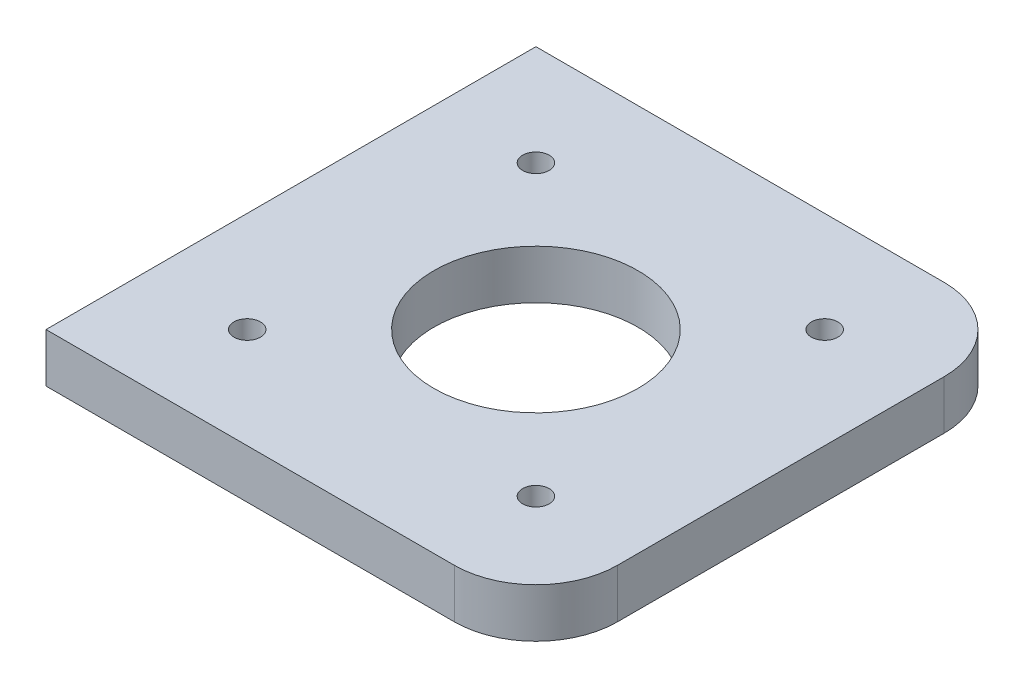
ISO-10303-21;
HEADER;
FILE_DESCRIPTION(('STEP AP214'),'2;1');
FILE_NAME('part.step','',(''),(''),'','','');
FILE_SCHEMA(('AUTOMOTIVE_DESIGN { 1 0 10303 214 1 1 1 1 }'));
ENDSEC;
DATA;
#1=APPLICATION_CONTEXT('core data for automotive mechanical design processes');
#2=APPLICATION_PROTOCOL_DEFINITION('international standard','automotive_design',2000,#1);
#3=PRODUCT_CONTEXT('',#1,'mechanical');
#4=PRODUCT('Part','Part','',(#3));
#5=PRODUCT_RELATED_PRODUCT_CATEGORY('part','',(#4));
#6=PRODUCT_DEFINITION_FORMATION('','',#4);
#7=PRODUCT_DEFINITION_CONTEXT('part definition',#1,'design');
#8=PRODUCT_DEFINITION('design','',#6,#7);
#9=PRODUCT_DEFINITION_SHAPE('','',#8);
#10=(LENGTH_UNIT() NAMED_UNIT(*) SI_UNIT(.MILLI.,.METRE.));
#11=(NAMED_UNIT(*) PLANE_ANGLE_UNIT() SI_UNIT($,.RADIAN.));
#12=(NAMED_UNIT(*) SI_UNIT($,.STERADIAN.) SOLID_ANGLE_UNIT());
#13=UNCERTAINTY_MEASURE_WITH_UNIT(LENGTH_MEASURE(1.E-05),#10,'distance_accuracy_value','');
#14=(GEOMETRIC_REPRESENTATION_CONTEXT(3) GLOBAL_UNCERTAINTY_ASSIGNED_CONTEXT((#13)) GLOBAL_UNIT_ASSIGNED_CONTEXT((#10,
#11,#12)) REPRESENTATION_CONTEXT('',''));
#15=CARTESIAN_POINT('',(0.,0.,0.));
#16=DIRECTION('',(0.,0.,1.));
#17=DIRECTION('',(1.,0.,0.));
#18=AXIS2_PLACEMENT_3D('',#15,#16,#17);
#19=CARTESIAN_POINT('',(0.,6.,0.));
#20=DIRECTION('',(0.,1.,0.));
#21=DIRECTION('',(0.,0.,1.));
#22=AXIS2_PLACEMENT_3D('',#19,#20,#21);
#23=PLANE('',#22);
#24=CARTESIAN_POINT('',(0.,6.,0.));
#25=DIRECTION('',(0.,1.,0.));
#26=DIRECTION('',(0.,0.,1.));
#27=AXIS2_PLACEMENT_3D('',#24,#25,#26);
#28=CIRCLE('',#27,1.625);
#29=CARTESIAN_POINT('',(0.,6.,1.625));
#30=VERTEX_POINT('',#29);
#31=EDGE_CURVE('E276',#30,#30,#28,.T.);
#32=ORIENTED_EDGE('',*,*,#31,.F.);
#33=EDGE_LOOP('',(#32));
#34=FACE_BOUND('',#33,.T.);
#35=CARTESIAN_POINT('',(35.36,6.,-35.36));
#36=DIRECTION('',(0.,1.,0.));
#37=DIRECTION('',(0.,0.,1.));
#38=AXIS2_PLACEMENT_3D('',#35,#36,#37);
#39=CIRCLE('',#38,1.625);
#40=CARTESIAN_POINT('',(35.36,6.,-33.735));
#41=VERTEX_POINT('',#40);
#42=EDGE_CURVE('E288',#41,#41,#39,.T.);
#43=ORIENTED_EDGE('',*,*,#42,.F.);
#44=EDGE_LOOP('',(#43));
#45=FACE_BOUND('',#44,.T.);
#46=DIRECTION('',(1.,0.,0.));
#47=VECTOR('',#46,1.);
#48=CARTESIAN_POINT('',(-12.32,6.,12.32));
#49=LINE('',#48,#47);
#50=CARTESIAN_POINT('',(-12.32,6.,12.32));
#51=VERTEX_POINT('',#50);
#52=CARTESIAN_POINT('',(37.68,6.,12.32));
#53=VERTEX_POINT('',#52);
#54=EDGE_CURVE('E87',#51,#53,#49,.T.);
#55=ORIENTED_EDGE('',*,*,#54,.T.);
#56=CARTESIAN_POINT('',(37.68,6.,2.32));
#57=DIRECTION('',(0.,1.,0.));
#58=DIRECTION('',(0.,0.,1.));
#59=AXIS2_PLACEMENT_3D('',#56,#57,#58);
#60=CIRCLE('',#59,10.);
#61=CARTESIAN_POINT('',(47.68,6.,2.32));
#62=VERTEX_POINT('',#61);
#63=EDGE_CURVE('E42',#53,#62,#60,.T.);
#64=ORIENTED_EDGE('',*,*,#63,.T.);
#65=DIRECTION('',(0.,0.,-1.));
#66=VECTOR('',#65,1.);
#67=CARTESIAN_POINT('',(47.68,6.,-47.68));
#68=LINE('',#67,#66);
#69=CARTESIAN_POINT('',(47.68,6.,-37.68));
#70=VERTEX_POINT('',#69);
#71=EDGE_CURVE('E94',#62,#70,#68,.T.);
#72=ORIENTED_EDGE('',*,*,#71,.T.);
#73=CARTESIAN_POINT('',(37.68,6.,-37.68));
#74=DIRECTION('',(0.,1.,0.));
#75=DIRECTION('',(0.,0.,1.));
#76=AXIS2_PLACEMENT_3D('',#73,#74,#75);
#77=CIRCLE('',#76,10.);
#78=CARTESIAN_POINT('',(37.68,6.,-47.68));
#79=VERTEX_POINT('',#78);
#80=EDGE_CURVE('E49',#70,#79,#77,.T.);
#81=ORIENTED_EDGE('',*,*,#80,.T.);
#82=DIRECTION('',(-1.,0.,0.));
#83=VECTOR('',#82,1.);
#84=CARTESIAN_POINT('',(-12.32,6.,-47.68));
#85=LINE('',#84,#83);
#86=CARTESIAN_POINT('',(-12.32,6.,-47.68));
#87=VERTEX_POINT('',#86);
#88=EDGE_CURVE('E99',#79,#87,#85,.T.);
#89=ORIENTED_EDGE('',*,*,#88,.T.);
#90=DIRECTION('',(0.,0.,1.));
#91=VECTOR('',#90,1.);
#92=CARTESIAN_POINT('',(-12.32,6.,-47.68));
#93=LINE('',#92,#91);
#94=EDGE_CURVE('E95',#87,#51,#93,.T.);
#95=ORIENTED_EDGE('',*,*,#94,.T.);
#96=EDGE_LOOP('',(#55,#64,#72,#81,#89,#95));
#97=FACE_BOUND('',#96,.T.);
#98=CARTESIAN_POINT('',(0.,6.,-35.36));
#99=DIRECTION('',(0.,1.,0.));
#100=DIRECTION('',(0.,0.,1.));
#101=AXIS2_PLACEMENT_3D('',#98,#99,#100);
#102=CIRCLE('',#101,1.625);
#103=CARTESIAN_POINT('',(0.,6.,-33.735));
#104=VERTEX_POINT('',#103);
#105=EDGE_CURVE('E140',#104,#104,#102,.T.);
#106=ORIENTED_EDGE('',*,*,#105,.F.);
#107=EDGE_LOOP('',(#106));
#108=FACE_BOUND('',#107,.T.);
#109=CARTESIAN_POINT('',(35.36,6.,0.));
#110=DIRECTION('',(0.,1.,0.));
#111=DIRECTION('',(0.,0.,1.));
#112=AXIS2_PLACEMENT_3D('',#109,#110,#111);
#113=CIRCLE('',#112,1.625);
#114=CARTESIAN_POINT('',(35.36,6.,1.625));
#115=VERTEX_POINT('',#114);
#116=EDGE_CURVE('E282',#115,#115,#113,.T.);
#117=ORIENTED_EDGE('',*,*,#116,.F.);
#118=EDGE_LOOP('',(#117));
#119=FACE_BOUND('',#118,.T.);
#120=CARTESIAN_POINT('',(17.68,6.,-17.68));
#121=DIRECTION('',(0.,1.,0.));
#122=DIRECTION('',(0.,0.,1.));
#123=AXIS2_PLACEMENT_3D('',#120,#121,#122);
#124=CIRCLE('',#123,12.5);
#125=CARTESIAN_POINT('',(17.68,6.,-5.18000000000001));
#126=VERTEX_POINT('',#125);
#127=EDGE_CURVE('E267',#126,#126,#124,.T.);
#128=ORIENTED_EDGE('',*,*,#127,.F.);
#129=EDGE_LOOP('',(#128));
#130=FACE_BOUND('',#129,.T.);
#131=ADVANCED_FACE('F34',(#34,#45,#97,#108,#119,#130),#23,.T.);
#132=CARTESIAN_POINT('',(0.,0.,0.));
#133=DIRECTION('',(0.,1.,0.));
#134=DIRECTION('',(0.,0.,1.));
#135=AXIS2_PLACEMENT_3D('',#132,#133,#134);
#136=PLANE('',#135);
#137=CARTESIAN_POINT('',(0.,0.,0.));
#138=DIRECTION('',(0.,1.,0.));
#139=DIRECTION('',(0.,0.,1.));
#140=AXIS2_PLACEMENT_3D('',#137,#138,#139);
#141=CIRCLE('',#140,1.625);
#142=CARTESIAN_POINT('',(0.,0.,1.625));
#143=VERTEX_POINT('',#142);
#144=EDGE_CURVE('E273',#143,#143,#141,.T.);
#145=ORIENTED_EDGE('',*,*,#144,.T.);
#146=EDGE_LOOP('',(#145));
#147=FACE_BOUND('',#146,.T.);
#148=CARTESIAN_POINT('',(35.36,0.,-35.36));
#149=DIRECTION('',(0.,1.,0.));
#150=DIRECTION('',(0.,0.,1.));
#151=AXIS2_PLACEMENT_3D('',#148,#149,#150);
#152=CIRCLE('',#151,1.625);
#153=CARTESIAN_POINT('',(35.36,0.,-33.735));
#154=VERTEX_POINT('',#153);
#155=EDGE_CURVE('E285',#154,#154,#152,.T.);
#156=ORIENTED_EDGE('',*,*,#155,.T.);
#157=EDGE_LOOP('',(#156));
#158=FACE_BOUND('',#157,.T.);
#159=DIRECTION('',(0.,0.,-1.));
#160=VECTOR('',#159,1.);
#161=CARTESIAN_POINT('',(47.68,0.,-47.68));
#162=LINE('',#161,#160);
#163=CARTESIAN_POINT('',(47.68,0.,2.32));
#164=VERTEX_POINT('',#163);
#165=CARTESIAN_POINT('',(47.68,0.,-37.68));
#166=VERTEX_POINT('',#165);
#167=EDGE_CURVE('E137',#164,#166,#162,.T.);
#168=ORIENTED_EDGE('',*,*,#167,.F.);
#169=CARTESIAN_POINT('',(37.68,0.,2.32));
#170=DIRECTION('',(0.,1.,0.));
#171=DIRECTION('',(0.,0.,1.));
#172=AXIS2_PLACEMENT_3D('',#169,#170,#171);
#173=CIRCLE('',#172,10.);
#174=CARTESIAN_POINT('',(37.68,0.,12.32));
#175=VERTEX_POINT('',#174);
#176=EDGE_CURVE('E120',#164,#175,#173,.F.);
#177=ORIENTED_EDGE('',*,*,#176,.T.);
#178=DIRECTION('',(1.,0.,0.));
#179=VECTOR('',#178,1.);
#180=CARTESIAN_POINT('',(-12.32,0.,12.32));
#181=LINE('',#180,#179);
#182=CARTESIAN_POINT('',(-12.32,0.,12.32));
#183=VERTEX_POINT('',#182);
#184=EDGE_CURVE('E136',#183,#175,#181,.T.);
#185=ORIENTED_EDGE('',*,*,#184,.F.);
#186=DIRECTION('',(0.,0.,1.));
#187=VECTOR('',#186,1.);
#188=CARTESIAN_POINT('',(-12.32,0.,-47.68));
#189=LINE('',#188,#187);
#190=CARTESIAN_POINT('',(-12.32,0.,-47.68));
#191=VERTEX_POINT('',#190);
#192=EDGE_CURVE('E107',#191,#183,#189,.T.);
#193=ORIENTED_EDGE('',*,*,#192,.F.);
#194=DIRECTION('',(-1.,0.,0.));
#195=VECTOR('',#194,1.);
#196=CARTESIAN_POINT('',(-12.32,0.,-47.68));
#197=LINE('',#196,#195);
#198=CARTESIAN_POINT('',(37.68,0.,-47.68));
#199=VERTEX_POINT('',#198);
#200=EDGE_CURVE('E103',#199,#191,#197,.T.);
#201=ORIENTED_EDGE('',*,*,#200,.F.);
#202=CARTESIAN_POINT('',(37.68,0.,-37.68));
#203=DIRECTION('',(0.,1.,0.));
#204=DIRECTION('',(0.,0.,1.));
#205=AXIS2_PLACEMENT_3D('',#202,#203,#204);
#206=CIRCLE('',#205,10.);
#207=EDGE_CURVE('E118',#199,#166,#206,.F.);
#208=ORIENTED_EDGE('',*,*,#207,.T.);
#209=EDGE_LOOP('',(#168,#177,#185,#193,#201,#208));
#210=FACE_BOUND('',#209,.T.);
#211=CARTESIAN_POINT('',(0.,0.,-35.36));
#212=DIRECTION('',(0.,1.,0.));
#213=DIRECTION('',(0.,0.,1.));
#214=AXIS2_PLACEMENT_3D('',#211,#212,#213);
#215=CIRCLE('',#214,1.625);
#216=CARTESIAN_POINT('',(0.,0.,-33.735));
#217=VERTEX_POINT('',#216);
#218=EDGE_CURVE('E291',#217,#217,#215,.T.);
#219=ORIENTED_EDGE('',*,*,#218,.T.);
#220=EDGE_LOOP('',(#219));
#221=FACE_BOUND('',#220,.T.);
#222=CARTESIAN_POINT('',(35.36,0.,0.));
#223=DIRECTION('',(0.,1.,0.));
#224=DIRECTION('',(0.,0.,1.));
#225=AXIS2_PLACEMENT_3D('',#222,#223,#224);
#226=CIRCLE('',#225,1.625);
#227=CARTESIAN_POINT('',(35.36,0.,1.625));
#228=VERTEX_POINT('',#227);
#229=EDGE_CURVE('E279',#228,#228,#226,.T.);
#230=ORIENTED_EDGE('',*,*,#229,.T.);
#231=EDGE_LOOP('',(#230));
#232=FACE_BOUND('',#231,.T.);
#233=CARTESIAN_POINT('',(17.68,0.,-17.68));
#234=DIRECTION('',(0.,1.,0.));
#235=DIRECTION('',(0.,0.,1.));
#236=AXIS2_PLACEMENT_3D('',#233,#234,#235);
#237=CIRCLE('',#236,12.5);
#238=CARTESIAN_POINT('',(17.68,0.,-5.18000000000001));
#239=VERTEX_POINT('',#238);
#240=EDGE_CURVE('E270',#239,#239,#237,.T.);
#241=ORIENTED_EDGE('',*,*,#240,.T.);
#242=EDGE_LOOP('',(#241));
#243=FACE_BOUND('',#242,.T.);
#244=ADVANCED_FACE('F134',(#147,#158,#210,#221,#232,#243),#136,.F.);
#245=CARTESIAN_POINT('',(-12.32,6.,-47.68));
#246=DIRECTION('',(1.,0.,0.));
#247=DIRECTION('',(0.,0.,-1.));
#248=AXIS2_PLACEMENT_3D('',#245,#246,#247);
#249=PLANE('',#248);
#250=ORIENTED_EDGE('',*,*,#192,.T.);
#251=DIRECTION('',(0.,-1.,0.));
#252=VECTOR('',#251,1.);
#253=CARTESIAN_POINT('',(-12.32,6.,12.32));
#254=LINE('',#253,#252);
#255=EDGE_CURVE('E91',#51,#183,#254,.T.);
#256=ORIENTED_EDGE('',*,*,#255,.F.);
#257=ORIENTED_EDGE('',*,*,#94,.F.);
#258=DIRECTION('',(0.,-1.,0.));
#259=VECTOR('',#258,1.);
#260=CARTESIAN_POINT('',(-12.32,6.,-47.68));
#261=LINE('',#260,#259);
#262=EDGE_CURVE('E109',#87,#191,#261,.T.);
#263=ORIENTED_EDGE('',*,*,#262,.T.);
#264=EDGE_LOOP('',(#250,#256,#257,#263));
#265=FACE_BOUND('',#264,.T.);
#266=ADVANCED_FACE('F105',(#265),#249,.F.);
#267=CARTESIAN_POINT('',(-12.32,6.,12.32));
#268=DIRECTION('',(0.,0.,-1.));
#269=DIRECTION('',(-1.,0.,0.));
#270=AXIS2_PLACEMENT_3D('',#267,#268,#269);
#271=PLANE('',#270);
#272=ORIENTED_EDGE('',*,*,#184,.T.);
#273=DIRECTION('',(0.,-1.,0.));
#274=VECTOR('',#273,1.);
#275=CARTESIAN_POINT('',(37.68,6.,12.32));
#276=LINE('',#275,#274);
#277=EDGE_CURVE('E57',#175,#53,#276,.F.);
#278=ORIENTED_EDGE('',*,*,#277,.T.);
#279=ORIENTED_EDGE('',*,*,#54,.F.);
#280=ORIENTED_EDGE('',*,*,#255,.T.);
#281=EDGE_LOOP('',(#272,#278,#279,#280));
#282=FACE_BOUND('',#281,.T.);
#283=ADVANCED_FACE('F89',(#282),#271,.F.);
#284=CARTESIAN_POINT('',(47.68,6.,-47.68));
#285=DIRECTION('',(-1.,0.,0.));
#286=DIRECTION('',(0.,0.,1.));
#287=AXIS2_PLACEMENT_3D('',#284,#285,#286);
#288=PLANE('',#287);
#289=ORIENTED_EDGE('',*,*,#71,.F.);
#290=DIRECTION('',(0.,-1.,0.));
#291=VECTOR('',#290,1.);
#292=CARTESIAN_POINT('',(47.68,6.,2.32));
#293=LINE('',#292,#291);
#294=EDGE_CURVE('E111',#62,#164,#293,.T.);
#295=ORIENTED_EDGE('',*,*,#294,.T.);
#296=ORIENTED_EDGE('',*,*,#167,.T.);
#297=DIRECTION('',(0.,-1.,0.));
#298=VECTOR('',#297,1.);
#299=CARTESIAN_POINT('',(47.68,6.,-37.68));
#300=LINE('',#299,#298);
#301=EDGE_CURVE('E108',#166,#70,#300,.F.);
#302=ORIENTED_EDGE('',*,*,#301,.T.);
#303=EDGE_LOOP('',(#289,#295,#296,#302));
#304=FACE_BOUND('',#303,.T.);
#305=ADVANCED_FACE('F127',(#304),#288,.F.);
#306=CARTESIAN_POINT('',(-12.32,6.,-47.68));
#307=DIRECTION('',(0.,0.,1.));
#308=DIRECTION('',(1.,0.,0.));
#309=AXIS2_PLACEMENT_3D('',#306,#307,#308);
#310=PLANE('',#309);
#311=ORIENTED_EDGE('',*,*,#88,.F.);
#312=DIRECTION('',(0.,-1.,0.));
#313=VECTOR('',#312,1.);
#314=CARTESIAN_POINT('',(37.68,6.,-47.68));
#315=LINE('',#314,#313);
#316=EDGE_CURVE('E11',#79,#199,#315,.T.);
#317=ORIENTED_EDGE('',*,*,#316,.T.);
#318=ORIENTED_EDGE('',*,*,#200,.T.);
#319=ORIENTED_EDGE('',*,*,#262,.F.);
#320=EDGE_LOOP('',(#311,#317,#318,#319));
#321=FACE_BOUND('',#320,.T.);
#322=ADVANCED_FACE('F145',(#321),#310,.F.);
#323=CARTESIAN_POINT('',(0.,6.,-35.36));
#324=DIRECTION('',(0.,-1.,0.));
#325=DIRECTION('',(0.,0.,-1.));
#326=AXIS2_PLACEMENT_3D('',#323,#324,#325);
#327=CYLINDRICAL_SURFACE('',#326,1.625);
#328=ORIENTED_EDGE('',*,*,#105,.T.);
#329=EDGE_LOOP('',(#328));
#330=FACE_BOUND('',#329,.T.);
#331=ORIENTED_EDGE('',*,*,#218,.F.);
#332=EDGE_LOOP('',(#331));
#333=FACE_BOUND('',#332,.T.);
#334=ADVANCED_FACE('F164',(#330,#333),#327,.F.);
#335=CARTESIAN_POINT('',(35.36,6.,-35.36));
#336=DIRECTION('',(0.,-1.,0.));
#337=DIRECTION('',(0.,0.,-1.));
#338=AXIS2_PLACEMENT_3D('',#335,#336,#337);
#339=CYLINDRICAL_SURFACE('',#338,1.625);
#340=ORIENTED_EDGE('',*,*,#42,.T.);
#341=EDGE_LOOP('',(#340));
#342=FACE_BOUND('',#341,.T.);
#343=ORIENTED_EDGE('',*,*,#155,.F.);
#344=EDGE_LOOP('',(#343));
#345=FACE_BOUND('',#344,.T.);
#346=ADVANCED_FACE('F197',(#342,#345),#339,.F.);
#347=CARTESIAN_POINT('',(35.36,6.,0.));
#348=DIRECTION('',(0.,-1.,0.));
#349=DIRECTION('',(0.,0.,-1.));
#350=AXIS2_PLACEMENT_3D('',#347,#348,#349);
#351=CYLINDRICAL_SURFACE('',#350,1.625);
#352=ORIENTED_EDGE('',*,*,#116,.T.);
#353=EDGE_LOOP('',(#352));
#354=FACE_BOUND('',#353,.T.);
#355=ORIENTED_EDGE('',*,*,#229,.F.);
#356=EDGE_LOOP('',(#355));
#357=FACE_BOUND('',#356,.T.);
#358=ADVANCED_FACE('F204',(#354,#357),#351,.F.);
#359=CARTESIAN_POINT('',(0.,6.,0.));
#360=DIRECTION('',(0.,-1.,0.));
#361=DIRECTION('',(0.,0.,-1.));
#362=AXIS2_PLACEMENT_3D('',#359,#360,#361);
#363=CYLINDRICAL_SURFACE('',#362,1.625);
#364=ORIENTED_EDGE('',*,*,#31,.T.);
#365=EDGE_LOOP('',(#364));
#366=FACE_BOUND('',#365,.T.);
#367=ORIENTED_EDGE('',*,*,#144,.F.);
#368=EDGE_LOOP('',(#367));
#369=FACE_BOUND('',#368,.T.);
#370=ADVANCED_FACE('F211',(#366,#369),#363,.F.);
#371=CARTESIAN_POINT('',(17.68,6.,-17.68));
#372=DIRECTION('',(0.,-1.,0.));
#373=DIRECTION('',(0.,0.,-1.));
#374=AXIS2_PLACEMENT_3D('',#371,#372,#373);
#375=CYLINDRICAL_SURFACE('',#374,12.5);
#376=ORIENTED_EDGE('',*,*,#127,.T.);
#377=EDGE_LOOP('',(#376));
#378=FACE_BOUND('',#377,.T.);
#379=ORIENTED_EDGE('',*,*,#240,.F.);
#380=EDGE_LOOP('',(#379));
#381=FACE_BOUND('',#380,.T.);
#382=ADVANCED_FACE('F152',(#378,#381),#375,.F.);
#383=CARTESIAN_POINT('',(37.68,6.,2.32));
#384=DIRECTION('',(0.,-1.,0.));
#385=DIRECTION('',(0.,0.,-1.));
#386=AXIS2_PLACEMENT_3D('',#383,#384,#385);
#387=CYLINDRICAL_SURFACE('',#386,10.);
#388=ORIENTED_EDGE('',*,*,#63,.F.);
#389=ORIENTED_EDGE('',*,*,#277,.F.);
#390=ORIENTED_EDGE('',*,*,#176,.F.);
#391=ORIENTED_EDGE('',*,*,#294,.F.);
#392=EDGE_LOOP('',(#388,#389,#390,#391));
#393=FACE_BOUND('',#392,.T.);
#394=ADVANCED_FACE('F132',(#393),#387,.T.);
#395=CARTESIAN_POINT('',(37.68,6.,-37.68));
#396=DIRECTION('',(0.,-1.,0.));
#397=DIRECTION('',(0.,0.,-1.));
#398=AXIS2_PLACEMENT_3D('',#395,#396,#397);
#399=CYLINDRICAL_SURFACE('',#398,10.);
#400=ORIENTED_EDGE('',*,*,#80,.F.);
#401=ORIENTED_EDGE('',*,*,#301,.F.);
#402=ORIENTED_EDGE('',*,*,#207,.F.);
#403=ORIENTED_EDGE('',*,*,#316,.F.);
#404=EDGE_LOOP('',(#400,#401,#402,#403));
#405=FACE_BOUND('',#404,.T.);
#406=ADVANCED_FACE('F36',(#405),#399,.T.);
#407=CLOSED_SHELL('',(#131,#244,#266,#283,#305,#322,#334,#346,#358,#370,#382,#394,#406));
#408=MANIFOLD_SOLID_BREP('B2',#407);
#409=ADVANCED_BREP_SHAPE_REPRESENTATION('',(#18,#408),#14);
#410=SHAPE_DEFINITION_REPRESENTATION(#9,#409);
ENDSEC;
END-ISO-10303-21;
